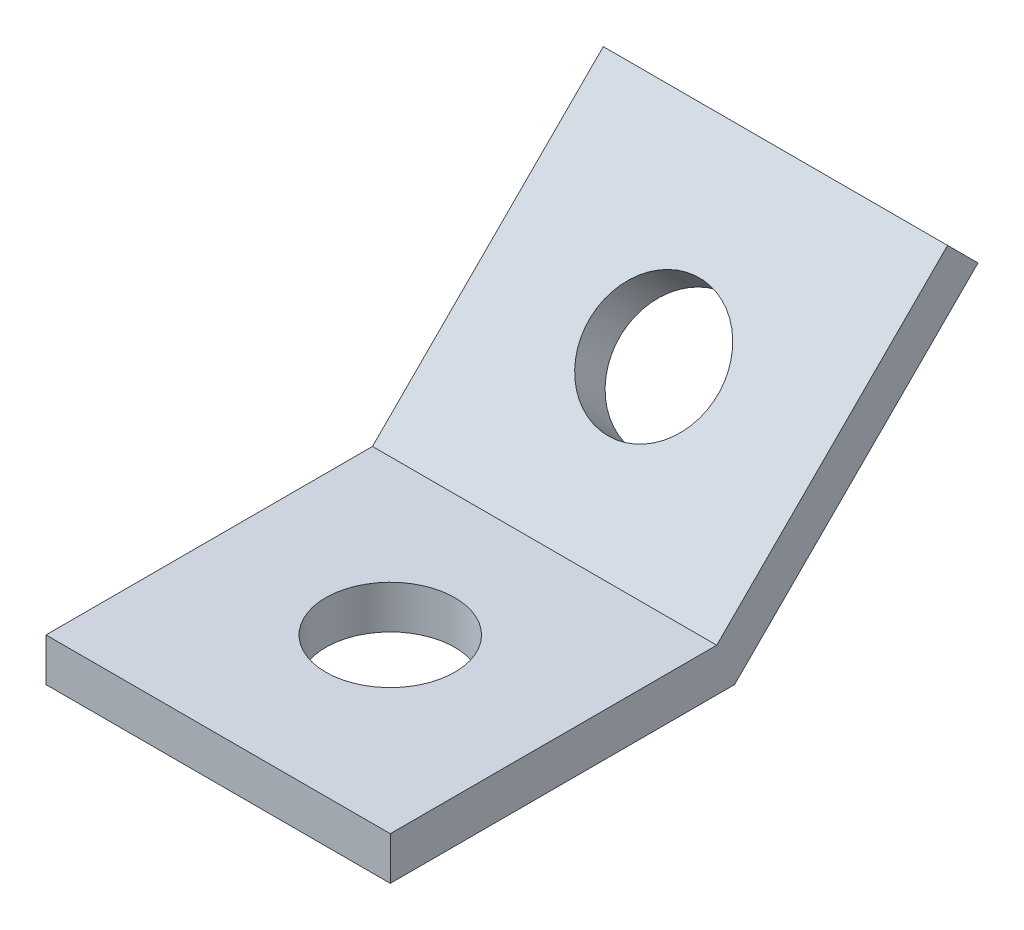
ISO-10303-21;
HEADER;
FILE_DESCRIPTION(('STEP AP214'),'2;1');
FILE_NAME('part.step','',(''),(''),'','','');
FILE_SCHEMA(('AUTOMOTIVE_DESIGN { 1 0 10303 214 1 1 1 1 }'));
ENDSEC;
DATA;
#1=APPLICATION_CONTEXT('core data for automotive mechanical design processes');
#2=APPLICATION_PROTOCOL_DEFINITION('international standard','automotive_design',2000,#1);
#3=PRODUCT_CONTEXT('',#1,'mechanical');
#4=PRODUCT('Part','Part','',(#3));
#5=PRODUCT_RELATED_PRODUCT_CATEGORY('part','',(#4));
#6=PRODUCT_DEFINITION_FORMATION('','',#4);
#7=PRODUCT_DEFINITION_CONTEXT('part definition',#1,'design');
#8=PRODUCT_DEFINITION('design','',#6,#7);
#9=PRODUCT_DEFINITION_SHAPE('','',#8);
#10=(LENGTH_UNIT() NAMED_UNIT(*) SI_UNIT(.MILLI.,.METRE.));
#11=(NAMED_UNIT(*) PLANE_ANGLE_UNIT() SI_UNIT($,.RADIAN.));
#12=(NAMED_UNIT(*) SI_UNIT($,.STERADIAN.) SOLID_ANGLE_UNIT());
#13=UNCERTAINTY_MEASURE_WITH_UNIT(LENGTH_MEASURE(1.E-05),#10,'distance_accuracy_value','');
#14=(GEOMETRIC_REPRESENTATION_CONTEXT(3) GLOBAL_UNCERTAINTY_ASSIGNED_CONTEXT((#13)) GLOBAL_UNIT_ASSIGNED_CONTEXT((#10,
#11,#12)) REPRESENTATION_CONTEXT('',''));
#15=CARTESIAN_POINT('',(0.,0.,0.));
#16=DIRECTION('',(0.,0.,1.));
#17=DIRECTION('',(1.,0.,0.));
#18=AXIS2_PLACEMENT_3D('',#15,#16,#17);
#19=CARTESIAN_POINT('',(25.4,17.9605122421383,-17.9605122421383));
#20=DIRECTION('',(0.,0.707106781186546,0.707106781186549));
#21=DIRECTION('',(0.,-0.707106781186549,0.707106781186546));
#22=AXIS2_PLACEMENT_3D('',#19,#20,#21);
#23=PLANE('',#22);
#24=CARTESIAN_POINT('',(12.7,8.98025612106917,-8.98025612106914));
#25=DIRECTION('',(0.,0.707106781186546,0.707106781186549));
#26=DIRECTION('',(0.,-0.707106781186549,0.707106781186546));
#27=AXIS2_PLACEMENT_3D('',#24,#25,#26);
#28=CIRCLE('',#27,4.7625);
#29=CARTESIAN_POINT('',(12.7,5.61266007566823,-5.61266007566821));
#30=VERTEX_POINT('',#29);
#31=EDGE_CURVE('E165',#30,#30,#28,.T.);
#32=ORIENTED_EDGE('',*,*,#31,.T.);
#33=EDGE_LOOP('',(#32));
#34=FACE_BOUND('',#33,.T.);
#35=DIRECTION('',(0.,0.707106781186549,-0.707106781186546));
#36=VECTOR('',#35,1.);
#37=CARTESIAN_POINT('',(0.,17.9605122421383,-17.9605122421383));
#38=LINE('',#37,#36);
#39=CARTESIAN_POINT('',(0.,0.,0.));
#40=VERTEX_POINT('',#39);
#41=CARTESIAN_POINT('',(0.,17.9605122421383,-17.9605122421383));
#42=VERTEX_POINT('',#41);
#43=EDGE_CURVE('E118',#40,#42,#38,.T.);
#44=ORIENTED_EDGE('',*,*,#43,.T.);
#45=DIRECTION('',(-1.,0.,0.));
#46=VECTOR('',#45,1.);
#47=CARTESIAN_POINT('',(25.4,17.9605122421383,-17.9605122421383));
#48=LINE('',#47,#46);
#49=CARTESIAN_POINT('',(25.4,17.9605122421383,-17.9605122421383));
#50=VERTEX_POINT('',#49);
#51=EDGE_CURVE('E11',#50,#42,#48,.T.);
#52=ORIENTED_EDGE('',*,*,#51,.F.);
#53=DIRECTION('',(0.,0.707106781186549,-0.707106781186546));
#54=VECTOR('',#53,1.);
#55=CARTESIAN_POINT('',(25.4,17.9605122421383,-17.9605122421383));
#56=LINE('',#55,#54);
#57=CARTESIAN_POINT('',(25.4,0.,0.));
#58=VERTEX_POINT('',#57);
#59=EDGE_CURVE('E128',#58,#50,#56,.T.);
#60=ORIENTED_EDGE('',*,*,#59,.F.);
#61=DIRECTION('',(-1.,0.,0.));
#62=VECTOR('',#61,1.);
#63=CARTESIAN_POINT('',(25.4,0.,0.));
#64=LINE('',#63,#62);
#65=EDGE_CURVE('E114',#58,#40,#64,.T.);
#66=ORIENTED_EDGE('',*,*,#65,.T.);
#67=EDGE_LOOP('',(#44,#52,#60,#66));
#68=FACE_BOUND('',#67,.T.);
#69=ADVANCED_FACE('F33',(#34,#68),#23,.F.);
#70=CARTESIAN_POINT('',(25.4,20.2055762724056,-15.715448211871));
#71=DIRECTION('',(0.,-0.707106781186549,0.707106781186546));
#72=DIRECTION('',(0.,-0.707106781186546,-0.707106781186549));
#73=AXIS2_PLACEMENT_3D('',#70,#71,#72);
#74=PLANE('',#73);
#75=DIRECTION('',(0.,0.707106781186546,0.707106781186549));
#76=VECTOR('',#75,1.);
#77=CARTESIAN_POINT('',(0.,20.2055762724056,-15.715448211871));
#78=LINE('',#77,#76);
#79=CARTESIAN_POINT('',(0.,20.2055762724056,-15.715448211871));
#80=VERTEX_POINT('',#79);
#81=EDGE_CURVE('E121',#42,#80,#78,.T.);
#82=ORIENTED_EDGE('',*,*,#81,.T.);
#83=DIRECTION('',(-1.,0.,0.));
#84=VECTOR('',#83,1.);
#85=CARTESIAN_POINT('',(25.4,20.2055762724056,-15.715448211871));
#86=LINE('',#85,#84);
#87=CARTESIAN_POINT('',(25.4,20.2055762724056,-15.715448211871));
#88=VERTEX_POINT('',#87);
#89=EDGE_CURVE('E42',#88,#80,#86,.T.);
#90=ORIENTED_EDGE('',*,*,#89,.F.);
#91=DIRECTION('',(0.,0.707106781186546,0.707106781186549));
#92=VECTOR('',#91,1.);
#93=CARTESIAN_POINT('',(25.4,20.2055762724056,-15.715448211871));
#94=LINE('',#93,#92);
#95=EDGE_CURVE('E87',#50,#88,#94,.T.);
#96=ORIENTED_EDGE('',*,*,#95,.F.);
#97=ORIENTED_EDGE('',*,*,#51,.T.);
#98=EDGE_LOOP('',(#82,#90,#96,#97));
#99=FACE_BOUND('',#98,.T.);
#100=ADVANCED_FACE('F157',(#99),#74,.F.);
#101=CARTESIAN_POINT('',(25.4,3.175,1.31512806053459));
#102=DIRECTION('',(0.,-0.707106781186546,-0.707106781186549));
#103=DIRECTION('',(0.,0.707106781186549,-0.707106781186546));
#104=AXIS2_PLACEMENT_3D('',#101,#102,#103);
#105=PLANE('',#104);
#106=CARTESIAN_POINT('',(12.7,11.2253201513365,-6.73519209080184));
#107=DIRECTION('',(0.,0.707106781186546,0.707106781186549));
#108=DIRECTION('',(0.,-0.707106781186549,0.707106781186546));
#109=AXIS2_PLACEMENT_3D('',#106,#107,#108);
#110=CIRCLE('',#109,4.7625);
#111=CARTESIAN_POINT('',(12.7,7.85772410593552,-3.36759604540091));
#112=VERTEX_POINT('',#111);
#113=EDGE_CURVE('E168',#112,#112,#110,.T.);
#114=ORIENTED_EDGE('',*,*,#113,.F.);
#115=EDGE_LOOP('',(#114));
#116=FACE_BOUND('',#115,.T.);
#117=DIRECTION('',(0.,-0.707106781186549,0.707106781186546));
#118=VECTOR('',#117,1.);
#119=CARTESIAN_POINT('',(0.,3.175,1.31512806053459));
#120=LINE('',#119,#118);
#121=CARTESIAN_POINT('',(0.,3.175,1.31512806053459));
#122=VERTEX_POINT('',#121);
#123=EDGE_CURVE('E123',#80,#122,#120,.T.);
#124=ORIENTED_EDGE('',*,*,#123,.T.);
#125=DIRECTION('',(-1.,0.,0.));
#126=VECTOR('',#125,1.);
#127=CARTESIAN_POINT('',(25.4,3.175,1.31512806053459));
#128=LINE('',#127,#126);
#129=CARTESIAN_POINT('',(25.4,3.175,1.31512806053459));
#130=VERTEX_POINT('',#129);
#131=EDGE_CURVE('E109',#130,#122,#128,.T.);
#132=ORIENTED_EDGE('',*,*,#131,.F.);
#133=DIRECTION('',(0.,-0.707106781186549,0.707106781186546));
#134=VECTOR('',#133,1.);
#135=CARTESIAN_POINT('',(25.4,3.175,1.31512806053459));
#136=LINE('',#135,#134);
#137=EDGE_CURVE('E100',#88,#130,#136,.T.);
#138=ORIENTED_EDGE('',*,*,#137,.F.);
#139=ORIENTED_EDGE('',*,*,#89,.T.);
#140=EDGE_LOOP('',(#124,#132,#138,#139));
#141=FACE_BOUND('',#140,.T.);
#142=ADVANCED_FACE('F135',(#116,#141),#105,.F.);
#143=CARTESIAN_POINT('',(25.4,3.175,25.4));
#144=DIRECTION('',(0.,-1.,0.));
#145=DIRECTION('',(0.,0.,-1.));
#146=AXIS2_PLACEMENT_3D('',#143,#144,#145);
#147=PLANE('',#146);
#148=CARTESIAN_POINT('',(12.7,3.175,12.7));
#149=DIRECTION('',(0.,1.,0.));
#150=DIRECTION('',(0.,0.,1.));
#151=AXIS2_PLACEMENT_3D('',#148,#149,#150);
#152=CIRCLE('',#151,4.7625);
#153=CARTESIAN_POINT('',(12.7,3.175,17.4625));
#154=VERTEX_POINT('',#153);
#155=EDGE_CURVE('E167',#154,#154,#152,.T.);
#156=ORIENTED_EDGE('',*,*,#155,.F.);
#157=EDGE_LOOP('',(#156));
#158=FACE_BOUND('',#157,.T.);
#159=DIRECTION('',(0.,0.,1.));
#160=VECTOR('',#159,1.);
#161=CARTESIAN_POINT('',(0.,3.175,25.4));
#162=LINE('',#161,#160);
#163=CARTESIAN_POINT('',(0.,3.175,25.4));
#164=VERTEX_POINT('',#163);
#165=EDGE_CURVE('E108',#122,#164,#162,.T.);
#166=ORIENTED_EDGE('',*,*,#165,.T.);
#167=DIRECTION('',(-1.,0.,0.));
#168=VECTOR('',#167,1.);
#169=CARTESIAN_POINT('',(25.4,3.175,25.4));
#170=LINE('',#169,#168);
#171=CARTESIAN_POINT('',(25.4,3.175,25.4));
#172=VERTEX_POINT('',#171);
#173=EDGE_CURVE('E105',#172,#164,#170,.T.);
#174=ORIENTED_EDGE('',*,*,#173,.F.);
#175=DIRECTION('',(0.,0.,1.));
#176=VECTOR('',#175,1.);
#177=CARTESIAN_POINT('',(25.4,3.175,25.4));
#178=LINE('',#177,#176);
#179=EDGE_CURVE('E94',#130,#172,#178,.T.);
#180=ORIENTED_EDGE('',*,*,#179,.F.);
#181=ORIENTED_EDGE('',*,*,#131,.T.);
#182=EDGE_LOOP('',(#166,#174,#180,#181));
#183=FACE_BOUND('',#182,.T.);
#184=ADVANCED_FACE('F106',(#158,#183),#147,.F.);
#185=CARTESIAN_POINT('',(25.4,0.,25.4));
#186=DIRECTION('',(0.,0.,-1.));
#187=DIRECTION('',(-1.,0.,0.));
#188=AXIS2_PLACEMENT_3D('',#185,#186,#187);
#189=PLANE('',#188);
#190=DIRECTION('',(0.,-1.,0.));
#191=VECTOR('',#190,1.);
#192=CARTESIAN_POINT('',(0.,0.,25.4));
#193=LINE('',#192,#191);
#194=CARTESIAN_POINT('',(0.,0.,25.4));
#195=VERTEX_POINT('',#194);
#196=EDGE_CURVE('E73',#164,#195,#193,.T.);
#197=ORIENTED_EDGE('',*,*,#196,.T.);
#198=DIRECTION('',(-1.,0.,0.));
#199=VECTOR('',#198,1.);
#200=CARTESIAN_POINT('',(25.4,0.,25.4));
#201=LINE('',#200,#199);
#202=CARTESIAN_POINT('',(25.4,0.,25.4));
#203=VERTEX_POINT('',#202);
#204=EDGE_CURVE('E110',#203,#195,#201,.T.);
#205=ORIENTED_EDGE('',*,*,#204,.F.);
#206=DIRECTION('',(0.,-1.,0.));
#207=VECTOR('',#206,1.);
#208=CARTESIAN_POINT('',(25.4,0.,25.4));
#209=LINE('',#208,#207);
#210=EDGE_CURVE('E98',#172,#203,#209,.T.);
#211=ORIENTED_EDGE('',*,*,#210,.F.);
#212=ORIENTED_EDGE('',*,*,#173,.T.);
#213=EDGE_LOOP('',(#197,#205,#211,#212));
#214=FACE_BOUND('',#213,.T.);
#215=ADVANCED_FACE('F112',(#214),#189,.F.);
#216=CARTESIAN_POINT('',(25.4,0.,0.));
#217=DIRECTION('',(0.,1.,0.));
#218=DIRECTION('',(0.,0.,1.));
#219=AXIS2_PLACEMENT_3D('',#216,#217,#218);
#220=PLANE('',#219);
#221=CARTESIAN_POINT('',(12.7,0.,12.7));
#222=DIRECTION('',(0.,1.,0.));
#223=DIRECTION('',(0.,0.,1.));
#224=AXIS2_PLACEMENT_3D('',#221,#222,#223);
#225=CIRCLE('',#224,4.7625);
#226=CARTESIAN_POINT('',(12.7,0.,17.4625));
#227=VERTEX_POINT('',#226);
#228=EDGE_CURVE('E36',#227,#227,#225,.T.);
#229=ORIENTED_EDGE('',*,*,#228,.T.);
#230=EDGE_LOOP('',(#229));
#231=FACE_BOUND('',#230,.T.);
#232=DIRECTION('',(0.,0.,-1.));
#233=VECTOR('',#232,1.);
#234=CARTESIAN_POINT('',(0.,0.,0.));
#235=LINE('',#234,#233);
#236=EDGE_CURVE('E79',#195,#40,#235,.T.);
#237=ORIENTED_EDGE('',*,*,#236,.T.);
#238=ORIENTED_EDGE('',*,*,#65,.F.);
#239=DIRECTION('',(0.,0.,-1.));
#240=VECTOR('',#239,1.);
#241=CARTESIAN_POINT('',(25.4,0.,0.));
#242=LINE('',#241,#240);
#243=EDGE_CURVE('E50',#203,#58,#242,.T.);
#244=ORIENTED_EDGE('',*,*,#243,.F.);
#245=ORIENTED_EDGE('',*,*,#204,.T.);
#246=EDGE_LOOP('',(#237,#238,#244,#245));
#247=FACE_BOUND('',#246,.T.);
#248=ADVANCED_FACE('F142',(#231,#247),#220,.F.);
#249=CARTESIAN_POINT('',(25.4,0.,0.));
#250=DIRECTION('',(1.,0.,0.));
#251=DIRECTION('',(0.,0.,-1.));
#252=AXIS2_PLACEMENT_3D('',#249,#250,#251);
#253=PLANE('',#252);
#254=ORIENTED_EDGE('',*,*,#59,.T.);
#255=ORIENTED_EDGE('',*,*,#95,.T.);
#256=ORIENTED_EDGE('',*,*,#137,.T.);
#257=ORIENTED_EDGE('',*,*,#179,.T.);
#258=ORIENTED_EDGE('',*,*,#210,.T.);
#259=ORIENTED_EDGE('',*,*,#243,.T.);
#260=EDGE_LOOP('',(#254,#255,#256,#257,#258,#259));
#261=FACE_BOUND('',#260,.T.);
#262=ADVANCED_FACE('F96',(#261),#253,.T.);
#263=CARTESIAN_POINT('',(0.,0.,0.));
#264=DIRECTION('',(1.,0.,0.));
#265=DIRECTION('',(0.,0.,-1.));
#266=AXIS2_PLACEMENT_3D('',#263,#264,#265);
#267=PLANE('',#266);
#268=ORIENTED_EDGE('',*,*,#43,.F.);
#269=ORIENTED_EDGE('',*,*,#236,.F.);
#270=ORIENTED_EDGE('',*,*,#196,.F.);
#271=ORIENTED_EDGE('',*,*,#165,.F.);
#272=ORIENTED_EDGE('',*,*,#123,.F.);
#273=ORIENTED_EDGE('',*,*,#81,.F.);
#274=EDGE_LOOP('',(#268,#269,#270,#271,#272,#273));
#275=FACE_BOUND('',#274,.T.);
#276=ADVANCED_FACE('F138',(#275),#267,.F.);
#277=CARTESIAN_POINT('',(12.7,-22.225,12.7));
#278=DIRECTION('',(0.,1.,0.));
#279=DIRECTION('',(0.,0.,1.));
#280=AXIS2_PLACEMENT_3D('',#277,#278,#279);
#281=CYLINDRICAL_SURFACE('',#280,4.7625);
#282=ORIENTED_EDGE('',*,*,#155,.T.);
#283=EDGE_LOOP('',(#282));
#284=FACE_BOUND('',#283,.T.);
#285=ORIENTED_EDGE('',*,*,#228,.F.);
#286=EDGE_LOOP('',(#285));
#287=FACE_BOUND('',#286,.T.);
#288=ADVANCED_FACE('F191',(#284,#287),#281,.F.);
#289=CARTESIAN_POINT('',(12.7,0.,-17.9605122421383));
#290=DIRECTION('',(0.,0.707106781186546,0.707106781186549));
#291=DIRECTION('',(0.,-0.707106781186549,0.707106781186546));
#292=AXIS2_PLACEMENT_3D('',#289,#290,#291);
#293=CYLINDRICAL_SURFACE('',#292,4.7625);
#294=ORIENTED_EDGE('',*,*,#113,.T.);
#295=EDGE_LOOP('',(#294));
#296=FACE_BOUND('',#295,.T.);
#297=ORIENTED_EDGE('',*,*,#31,.F.);
#298=EDGE_LOOP('',(#297));
#299=FACE_BOUND('',#298,.T.);
#300=ADVANCED_FACE('F178',(#296,#299),#293,.F.);
#301=CLOSED_SHELL('',(#69,#100,#142,#184,#215,#248,#262,#276,#288,#300));
#302=MANIFOLD_SOLID_BREP('B2',#301);
#303=ADVANCED_BREP_SHAPE_REPRESENTATION('',(#18,#302),#14);
#304=SHAPE_DEFINITION_REPRESENTATION(#9,#303);
ENDSEC;
END-ISO-10303-21;
